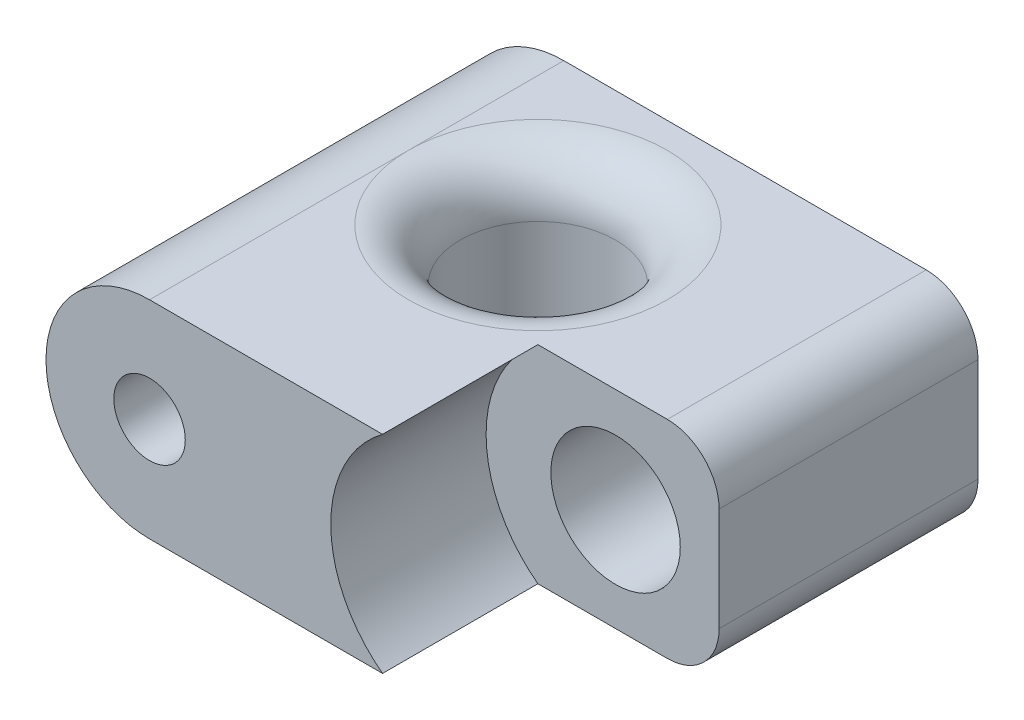
ISO-10303-21;
HEADER;
FILE_DESCRIPTION(('STEP AP214'),'2;1');
FILE_NAME('part.step','',(''),(''),'','','');
FILE_SCHEMA(('AUTOMOTIVE_DESIGN { 1 0 10303 214 1 1 1 1 }'));
ENDSEC;
DATA;
#1=APPLICATION_CONTEXT('core data for automotive mechanical design processes');
#2=APPLICATION_PROTOCOL_DEFINITION('international standard','automotive_design',2000,#1);
#3=PRODUCT_CONTEXT('',#1,'mechanical');
#4=PRODUCT('Part','Part','',(#3));
#5=PRODUCT_RELATED_PRODUCT_CATEGORY('part','',(#4));
#6=PRODUCT_DEFINITION_FORMATION('','',#4);
#7=PRODUCT_DEFINITION_CONTEXT('part definition',#1,'design');
#8=PRODUCT_DEFINITION('design','',#6,#7);
#9=PRODUCT_DEFINITION_SHAPE('','',#8);
#10=(LENGTH_UNIT() NAMED_UNIT(*) SI_UNIT(.MILLI.,.METRE.));
#11=(NAMED_UNIT(*) PLANE_ANGLE_UNIT() SI_UNIT($,.RADIAN.));
#12=(NAMED_UNIT(*) SI_UNIT($,.STERADIAN.) SOLID_ANGLE_UNIT());
#13=UNCERTAINTY_MEASURE_WITH_UNIT(LENGTH_MEASURE(1.E-05),#10,'distance_accuracy_value','');
#14=(GEOMETRIC_REPRESENTATION_CONTEXT(3) GLOBAL_UNCERTAINTY_ASSIGNED_CONTEXT((#13)) GLOBAL_UNIT_ASSIGNED_CONTEXT((#10,
#11,#12)) REPRESENTATION_CONTEXT('',''));
#15=CARTESIAN_POINT('',(0.,0.,0.));
#16=DIRECTION('',(0.,0.,1.));
#17=DIRECTION('',(1.,0.,0.));
#18=AXIS2_PLACEMENT_3D('',#15,#16,#17);
#19=CARTESIAN_POINT('',(0.,0.,20.32));
#20=DIRECTION('',(-1.,0.,0.));
#21=DIRECTION('',(0.,-1.,0.));
#22=AXIS2_PLACEMENT_3D('',#19,#20,#21);
#23=PLANE('',#22);
#24=DIRECTION('',(0.,1.,0.));
#25=VECTOR('',#24,1.);
#26=CARTESIAN_POINT('',(0.,0.,12.7));
#27=LINE('',#26,#25);
#28=CARTESIAN_POINT('',(0.,2.54,12.7));
#29=VERTEX_POINT('',#28);
#30=CARTESIAN_POINT('',(0.,7.62,12.7));
#31=VERTEX_POINT('',#30);
#32=EDGE_CURVE('E46',#29,#31,#27,.T.);
#33=ORIENTED_EDGE('',*,*,#32,.F.);
#34=DIRECTION('',(0.,0.,-1.));
#35=VECTOR('',#34,1.);
#36=CARTESIAN_POINT('',(0.,2.54,20.32));
#37=LINE('',#36,#35);
#38=CARTESIAN_POINT('',(0.,2.54,0.));
#39=VERTEX_POINT('',#38);
#40=EDGE_CURVE('E141',#29,#39,#37,.T.);
#41=ORIENTED_EDGE('',*,*,#40,.T.);
#42=DIRECTION('',(0.,1.,0.));
#43=VECTOR('',#42,1.);
#44=CARTESIAN_POINT('',(0.,0.,0.));
#45=LINE('',#44,#43);
#46=CARTESIAN_POINT('',(0.,7.62,0.));
#47=VERTEX_POINT('',#46);
#48=EDGE_CURVE('E228',#39,#47,#45,.T.);
#49=ORIENTED_EDGE('',*,*,#48,.T.);
#50=DIRECTION('',(0.,0.,-1.));
#51=VECTOR('',#50,1.);
#52=CARTESIAN_POINT('',(0.,7.62,20.32));
#53=LINE('',#52,#51);
#54=EDGE_CURVE('E133',#47,#31,#53,.F.);
#55=ORIENTED_EDGE('',*,*,#54,.T.);
#56=EDGE_LOOP('',(#33,#41,#49,#55));
#57=FACE_BOUND('',#56,.T.);
#58=ADVANCED_FACE('F32',(#57),#23,.F.);
#59=CARTESIAN_POINT('',(-2.54,2.54,20.32));
#60=DIRECTION('',(0.,0.,-1.));
#61=DIRECTION('',(-1.,0.,0.));
#62=AXIS2_PLACEMENT_3D('',#59,#60,#61);
#63=CYLINDRICAL_SURFACE('',#62,2.54);
#64=ORIENTED_EDGE('',*,*,#40,.F.);
#65=CARTESIAN_POINT('',(-2.54,2.54,12.7));
#66=DIRECTION('',(0.,0.,1.));
#67=DIRECTION('',(1.,0.,0.));
#68=AXIS2_PLACEMENT_3D('',#65,#66,#67);
#69=CIRCLE('',#68,2.54);
#70=CARTESIAN_POINT('',(-2.54,0.,12.7));
#71=VERTEX_POINT('',#70);
#72=EDGE_CURVE('E221',#29,#71,#69,.F.);
#73=ORIENTED_EDGE('',*,*,#72,.T.);
#74=DIRECTION('',(0.,0.,-1.));
#75=VECTOR('',#74,1.);
#76=CARTESIAN_POINT('',(-2.54,0.,20.32));
#77=LINE('',#76,#75);
#78=CARTESIAN_POINT('',(-2.54,0.,0.));
#79=VERTEX_POINT('',#78);
#80=EDGE_CURVE('E148',#79,#71,#77,.F.);
#81=ORIENTED_EDGE('',*,*,#80,.F.);
#82=CARTESIAN_POINT('',(-2.54,2.54,0.));
#83=DIRECTION('',(0.,0.,1.));
#84=DIRECTION('',(1.,0.,0.));
#85=AXIS2_PLACEMENT_3D('',#82,#83,#84);
#86=CIRCLE('',#85,2.54);
#87=EDGE_CURVE('E145',#39,#79,#86,.F.);
#88=ORIENTED_EDGE('',*,*,#87,.F.);
#89=EDGE_LOOP('',(#64,#73,#81,#88));
#90=FACE_BOUND('',#89,.T.);
#91=ADVANCED_FACE('F209',(#90),#63,.T.);
#92=CARTESIAN_POINT('',(-2.54,7.62,20.32));
#93=DIRECTION('',(0.,0.,-1.));
#94=DIRECTION('',(-1.,0.,0.));
#95=AXIS2_PLACEMENT_3D('',#92,#93,#94);
#96=CYLINDRICAL_SURFACE('',#95,2.54);
#97=DIRECTION('',(0.,0.,-1.));
#98=VECTOR('',#97,1.);
#99=CARTESIAN_POINT('',(-2.54,10.16,20.32));
#100=LINE('',#99,#98);
#101=CARTESIAN_POINT('',(-2.54,10.16,12.7));
#102=VERTEX_POINT('',#101);
#103=CARTESIAN_POINT('',(-2.54,10.16,0.));
#104=VERTEX_POINT('',#103);
#105=EDGE_CURVE('E151',#102,#104,#100,.T.);
#106=ORIENTED_EDGE('',*,*,#105,.F.);
#107=CARTESIAN_POINT('',(-2.54,7.62,12.7));
#108=DIRECTION('',(0.,0.,1.));
#109=DIRECTION('',(1.,0.,0.));
#110=AXIS2_PLACEMENT_3D('',#107,#108,#109);
#111=CIRCLE('',#110,2.54);
#112=EDGE_CURVE('E11',#102,#31,#111,.F.);
#113=ORIENTED_EDGE('',*,*,#112,.T.);
#114=ORIENTED_EDGE('',*,*,#54,.F.);
#115=CARTESIAN_POINT('',(-2.54,7.62,0.));
#116=DIRECTION('',(0.,0.,1.));
#117=DIRECTION('',(1.,0.,0.));
#118=AXIS2_PLACEMENT_3D('',#115,#116,#117);
#119=CIRCLE('',#118,2.54);
#120=EDGE_CURVE('E143',#104,#47,#119,.F.);
#121=ORIENTED_EDGE('',*,*,#120,.F.);
#122=EDGE_LOOP('',(#106,#113,#114,#121));
#123=FACE_BOUND('',#122,.T.);
#124=ADVANCED_FACE('F214',(#123),#96,.T.);
#125=CARTESIAN_POINT('',(0.,10.16,20.32));
#126=DIRECTION('',(0.,-1.,0.));
#127=DIRECTION('',(1.,0.,0.));
#128=AXIS2_PLACEMENT_3D('',#125,#126,#127);
#129=PLANE('',#128);
#130=DIRECTION('',(-1.,0.,0.));
#131=VECTOR('',#130,1.);
#132=CARTESIAN_POINT('',(0.,10.16,20.32));
#133=LINE('',#132,#131);
#134=CARTESIAN_POINT('',(-8.89,10.16,20.32));
#135=VERTEX_POINT('',#134);
#136=CARTESIAN_POINT('',(-20.32,10.16,20.32));
#137=VERTEX_POINT('',#136);
#138=EDGE_CURVE('E121',#135,#137,#133,.T.);
#139=ORIENTED_EDGE('',*,*,#138,.F.);
#140=DIRECTION('',(0.,0.,1.));
#141=VECTOR('',#140,1.);
#142=CARTESIAN_POINT('',(-8.89,10.16,12.7));
#143=LINE('',#142,#141);
#144=CARTESIAN_POINT('',(-8.89,10.16,12.7));
#145=VERTEX_POINT('',#144);
#146=EDGE_CURVE('E105',#135,#145,#143,.F.);
#147=ORIENTED_EDGE('',*,*,#146,.T.);
#148=DIRECTION('',(-1.,0.,0.));
#149=VECTOR('',#148,1.);
#150=CARTESIAN_POINT('',(0.,10.16,12.7));
#151=LINE('',#150,#149);
#152=EDGE_CURVE('E222',#102,#145,#151,.T.);
#153=ORIENTED_EDGE('',*,*,#152,.F.);
#154=ORIENTED_EDGE('',*,*,#105,.T.);
#155=DIRECTION('',(-1.,0.,0.));
#156=VECTOR('',#155,1.);
#157=CARTESIAN_POINT('',(0.,10.16,0.));
#158=LINE('',#157,#156);
#159=CARTESIAN_POINT('',(-20.32,10.16,0.));
#160=VERTEX_POINT('',#159);
#161=EDGE_CURVE('E135',#104,#160,#158,.T.);
#162=ORIENTED_EDGE('',*,*,#161,.T.);
#163=DIRECTION('',(0.,0.,-1.));
#164=VECTOR('',#163,1.);
#165=CARTESIAN_POINT('',(-20.32,10.16,20.32));
#166=LINE('',#165,#164);
#167=CARTESIAN_POINT('',(-20.32,10.16,7.62));
#168=VERTEX_POINT('',#167);
#169=EDGE_CURVE('E165',#160,#168,#166,.F.);
#170=ORIENTED_EDGE('',*,*,#169,.T.);
#171=CARTESIAN_POINT('',(-13.97,10.16,7.62));
#172=DIRECTION('',(0.,-1.,0.));
#173=DIRECTION('',(1.,0.,0.));
#174=AXIS2_PLACEMENT_3D('',#171,#172,#173);
#175=CIRCLE('',#174,6.35);
#176=EDGE_CURVE('E39',#168,#168,#175,.T.);
#177=ORIENTED_EDGE('',*,*,#176,.T.);
#178=EDGE_CURVE('E129',#168,#137,#166,.F.);
#179=ORIENTED_EDGE('',*,*,#178,.T.);
#180=EDGE_LOOP('',(#139,#147,#153,#154,#162,#170,#177,#179));
#181=FACE_BOUND('',#180,.T.);
#182=ADVANCED_FACE('F127',(#181),#129,.F.);
#183=CARTESIAN_POINT('',(0.,0.,20.32));
#184=DIRECTION('',(0.,1.,0.));
#185=DIRECTION('',(-1.,0.,0.));
#186=AXIS2_PLACEMENT_3D('',#183,#184,#185);
#187=PLANE('',#186);
#188=DIRECTION('',(1.,0.,0.));
#189=VECTOR('',#188,1.);
#190=CARTESIAN_POINT('',(0.,0.,12.7));
#191=LINE('',#190,#189);
#192=CARTESIAN_POINT('',(-8.89,0.,12.7));
#193=VERTEX_POINT('',#192);
#194=EDGE_CURVE('E236',#193,#71,#191,.T.);
#195=ORIENTED_EDGE('',*,*,#194,.F.);
#196=DIRECTION('',(0.,0.,1.));
#197=VECTOR('',#196,1.);
#198=CARTESIAN_POINT('',(-8.89,0.,12.7));
#199=LINE('',#198,#197);
#200=CARTESIAN_POINT('',(-8.89,0.,20.32));
#201=VERTEX_POINT('',#200);
#202=EDGE_CURVE('E116',#193,#201,#199,.T.);
#203=ORIENTED_EDGE('',*,*,#202,.T.);
#204=DIRECTION('',(1.,0.,0.));
#205=VECTOR('',#204,1.);
#206=CARTESIAN_POINT('',(0.,0.,20.32));
#207=LINE('',#206,#205);
#208=CARTESIAN_POINT('',(-20.32,0.,20.32));
#209=VERTEX_POINT('',#208);
#210=EDGE_CURVE('E124',#209,#201,#207,.T.);
#211=ORIENTED_EDGE('',*,*,#210,.F.);
#212=DIRECTION('',(0.,0.,1.));
#213=VECTOR('',#212,1.);
#214=CARTESIAN_POINT('',(-20.32,0.,0.));
#215=LINE('',#214,#213);
#216=CARTESIAN_POINT('',(-20.32,0.,7.62));
#217=VERTEX_POINT('',#216);
#218=EDGE_CURVE('E158',#209,#217,#215,.F.);
#219=ORIENTED_EDGE('',*,*,#218,.T.);
#220=CARTESIAN_POINT('',(-13.97,0.,7.62));
#221=DIRECTION('',(0.,1.,0.));
#222=DIRECTION('',(-1.,0.,0.));
#223=AXIS2_PLACEMENT_3D('',#220,#221,#222);
#224=CIRCLE('',#223,6.35);
#225=EDGE_CURVE('E168',#217,#217,#224,.T.);
#226=ORIENTED_EDGE('',*,*,#225,.T.);
#227=CARTESIAN_POINT('',(-20.32,0.,0.));
#228=VERTEX_POINT('',#227);
#229=EDGE_CURVE('E157',#217,#228,#215,.F.);
#230=ORIENTED_EDGE('',*,*,#229,.T.);
#231=DIRECTION('',(1.,0.,0.));
#232=VECTOR('',#231,1.);
#233=CARTESIAN_POINT('',(0.,0.,0.));
#234=LINE('',#233,#232);
#235=EDGE_CURVE('E131',#228,#79,#234,.T.);
#236=ORIENTED_EDGE('',*,*,#235,.T.);
#237=ORIENTED_EDGE('',*,*,#80,.T.);
#238=EDGE_LOOP('',(#195,#203,#211,#219,#226,#230,#236,#237));
#239=FACE_BOUND('',#238,.T.);
#240=ADVANCED_FACE('F188',(#239),#187,.F.);
#241=CARTESIAN_POINT('',(0.,0.,20.32));
#242=DIRECTION('',(0.,0.,1.));
#243=DIRECTION('',(1.,0.,0.));
#244=AXIS2_PLACEMENT_3D('',#241,#242,#243);
#245=PLANE('',#244);
#246=CARTESIAN_POINT('',(-20.32,5.08,20.32));
#247=DIRECTION('',(0.,0.,1.));
#248=DIRECTION('',(1.,0.,0.));
#249=AXIS2_PLACEMENT_3D('',#246,#247,#248);
#250=CIRCLE('',#249,1.75259999999999);
#251=CARTESIAN_POINT('',(-18.5674,5.08,20.32));
#252=VERTEX_POINT('',#251);
#253=EDGE_CURVE('E246',#252,#252,#250,.T.);
#254=ORIENTED_EDGE('',*,*,#253,.F.);
#255=EDGE_LOOP('',(#254));
#256=FACE_BOUND('',#255,.T.);
#257=CARTESIAN_POINT('',(-5.08,5.08,20.32));
#258=DIRECTION('',(0.,0.,1.));
#259=DIRECTION('',(1.,0.,0.));
#260=AXIS2_PLACEMENT_3D('',#257,#258,#259);
#261=CIRCLE('',#260,6.35);
#262=EDGE_CURVE('E108',#135,#201,#261,.T.);
#263=ORIENTED_EDGE('',*,*,#262,.F.);
#264=ORIENTED_EDGE('',*,*,#138,.T.);
#265=CARTESIAN_POINT('',(-20.32,5.08,20.32));
#266=DIRECTION('',(0.,0.,1.));
#267=DIRECTION('',(1.,0.,0.));
#268=AXIS2_PLACEMENT_3D('',#265,#266,#267);
#269=CIRCLE('',#268,5.08);
#270=CARTESIAN_POINT('',(-25.4,5.08,20.32));
#271=VERTEX_POINT('',#270);
#272=EDGE_CURVE('E153',#137,#271,#269,.T.);
#273=ORIENTED_EDGE('',*,*,#272,.T.);
#274=CARTESIAN_POINT('',(-20.32,5.08,20.32));
#275=DIRECTION('',(0.,0.,1.));
#276=DIRECTION('',(1.,0.,0.));
#277=AXIS2_PLACEMENT_3D('',#274,#275,#276);
#278=CIRCLE('',#277,5.08);
#279=EDGE_CURVE('E155',#271,#209,#278,.T.);
#280=ORIENTED_EDGE('',*,*,#279,.T.);
#281=ORIENTED_EDGE('',*,*,#210,.T.);
#282=EDGE_LOOP('',(#263,#264,#273,#280,#281));
#283=FACE_BOUND('',#282,.T.);
#284=ADVANCED_FACE('F120',(#256,#283),#245,.T.);
#285=CARTESIAN_POINT('',(0.,0.,0.));
#286=DIRECTION('',(0.,0.,1.));
#287=DIRECTION('',(1.,0.,0.));
#288=AXIS2_PLACEMENT_3D('',#285,#286,#287);
#289=PLANE('',#288);
#290=CARTESIAN_POINT('',(-20.32,5.08,0.));
#291=DIRECTION('',(0.,0.,1.));
#292=DIRECTION('',(1.,0.,0.));
#293=AXIS2_PLACEMENT_3D('',#290,#291,#292);
#294=CIRCLE('',#293,1.7526);
#295=CARTESIAN_POINT('',(-18.5674,5.08,0.));
#296=VERTEX_POINT('',#295);
#297=EDGE_CURVE('E249',#296,#296,#294,.T.);
#298=ORIENTED_EDGE('',*,*,#297,.T.);
#299=EDGE_LOOP('',(#298));
#300=FACE_BOUND('',#299,.T.);
#301=CARTESIAN_POINT('',(-5.08,5.04796392922587,0.));
#302=DIRECTION('',(0.,0.,1.));
#303=DIRECTION('',(1.,0.,0.));
#304=AXIS2_PLACEMENT_3D('',#301,#302,#303);
#305=CIRCLE('',#304,3.175);
#306=CARTESIAN_POINT('',(-1.905,5.04796392922587,0.));
#307=VERTEX_POINT('',#306);
#308=EDGE_CURVE('E243',#307,#307,#305,.T.);
#309=ORIENTED_EDGE('',*,*,#308,.T.);
#310=EDGE_LOOP('',(#309));
#311=FACE_BOUND('',#310,.T.);
#312=ORIENTED_EDGE('',*,*,#235,.F.);
#313=CARTESIAN_POINT('',(-20.32,5.08,0.));
#314=DIRECTION('',(0.,0.,1.));
#315=DIRECTION('',(1.,0.,0.));
#316=AXIS2_PLACEMENT_3D('',#313,#314,#315);
#317=CIRCLE('',#316,5.08);
#318=CARTESIAN_POINT('',(-25.4,5.08,0.));
#319=VERTEX_POINT('',#318);
#320=EDGE_CURVE('E163',#228,#319,#317,.F.);
#321=ORIENTED_EDGE('',*,*,#320,.T.);
#322=CARTESIAN_POINT('',(-20.32,5.08,0.));
#323=DIRECTION('',(0.,0.,1.));
#324=DIRECTION('',(1.,0.,0.));
#325=AXIS2_PLACEMENT_3D('',#322,#323,#324);
#326=CIRCLE('',#325,5.08);
#327=EDGE_CURVE('E161',#319,#160,#326,.F.);
#328=ORIENTED_EDGE('',*,*,#327,.T.);
#329=ORIENTED_EDGE('',*,*,#161,.F.);
#330=ORIENTED_EDGE('',*,*,#120,.T.);
#331=ORIENTED_EDGE('',*,*,#48,.F.);
#332=ORIENTED_EDGE('',*,*,#87,.T.);
#333=EDGE_LOOP('',(#312,#321,#328,#329,#330,#331,#332));
#334=FACE_BOUND('',#333,.T.);
#335=ADVANCED_FACE('F229',(#300,#311,#334),#289,.F.);
#336=CARTESIAN_POINT('',(-20.32,5.08,0.));
#337=DIRECTION('',(0.,0.,1.));
#338=DIRECTION('',(1.,0.,0.));
#339=AXIS2_PLACEMENT_3D('',#336,#337,#338);
#340=CYLINDRICAL_SURFACE('',#339,5.08);
#341=ORIENTED_EDGE('',*,*,#169,.F.);
#342=ORIENTED_EDGE('',*,*,#327,.F.);
#343=DIRECTION('',(0.,0.,-1.));
#344=VECTOR('',#343,1.);
#345=CARTESIAN_POINT('',(-25.4,5.08,0.));
#346=LINE('',#345,#344);
#347=EDGE_CURVE('E115',#271,#319,#346,.T.);
#348=ORIENTED_EDGE('',*,*,#347,.F.);
#349=ORIENTED_EDGE('',*,*,#272,.F.);
#350=ORIENTED_EDGE('',*,*,#178,.F.);
#351=EDGE_LOOP('',(#341,#342,#348,#349,#350));
#352=FACE_BOUND('',#351,.T.);
#353=ADVANCED_FACE('F179',(#352),#340,.T.);
#354=CARTESIAN_POINT('',(-20.32,5.08,0.));
#355=DIRECTION('',(0.,0.,-1.));
#356=DIRECTION('',(-1.,0.,0.));
#357=AXIS2_PLACEMENT_3D('',#354,#355,#356);
#358=CYLINDRICAL_SURFACE('',#357,5.08);
#359=ORIENTED_EDGE('',*,*,#320,.F.);
#360=ORIENTED_EDGE('',*,*,#229,.F.);
#361=ORIENTED_EDGE('',*,*,#218,.F.);
#362=ORIENTED_EDGE('',*,*,#279,.F.);
#363=ORIENTED_EDGE('',*,*,#347,.T.);
#364=EDGE_LOOP('',(#359,#360,#361,#362,#363));
#365=FACE_BOUND('',#364,.T.);
#366=ADVANCED_FACE('F191',(#365),#358,.T.);
#367=CARTESIAN_POINT('',(-13.97,0.,7.62));
#368=DIRECTION('',(0.,1.,0.));
#369=DIRECTION('',(-1.,0.,0.));
#370=AXIS2_PLACEMENT_3D('',#367,#368,#369);
#371=CYLINDRICAL_SURFACE('',#370,3.81);
#372=CARTESIAN_POINT('',(-13.97,2.54,7.62));
#373=DIRECTION('',(0.,1.,0.));
#374=DIRECTION('',(-1.,0.,0.));
#375=AXIS2_PLACEMENT_3D('',#372,#373,#374);
#376=CIRCLE('',#375,3.81);
#377=CARTESIAN_POINT('',(-17.78,2.54,7.62));
#378=VERTEX_POINT('',#377);
#379=EDGE_CURVE('E174',#378,#378,#376,.F.);
#380=ORIENTED_EDGE('',*,*,#379,.T.);
#381=EDGE_LOOP('',(#380));
#382=FACE_BOUND('',#381,.T.);
#383=CARTESIAN_POINT('',(-13.97,7.62,7.62));
#384=DIRECTION('',(0.,-1.,0.));
#385=DIRECTION('',(1.,0.,0.));
#386=AXIS2_PLACEMENT_3D('',#383,#384,#385);
#387=CIRCLE('',#386,3.81);
#388=CARTESIAN_POINT('',(-10.16,7.62,7.62));
#389=VERTEX_POINT('',#388);
#390=EDGE_CURVE('E171',#389,#389,#387,.F.);
#391=ORIENTED_EDGE('',*,*,#390,.T.);
#392=EDGE_LOOP('',(#391));
#393=FACE_BOUND('',#392,.T.);
#394=ADVANCED_FACE('F197',(#382,#393),#371,.F.);
#395=CARTESIAN_POINT('',(-13.97,2.54,7.62));
#396=DIRECTION('',(0.,1.,0.));
#397=DIRECTION('',(-1.,0.,0.));
#398=AXIS2_PLACEMENT_3D('',#395,#396,#397);
#399=TOROIDAL_SURFACE('',#398,6.35,2.54);
#400=ORIENTED_EDGE('',*,*,#379,.F.);
#401=EDGE_LOOP('',(#400));
#402=FACE_BOUND('',#401,.T.);
#403=ORIENTED_EDGE('',*,*,#225,.F.);
#404=EDGE_LOOP('',(#403));
#405=FACE_BOUND('',#404,.T.);
#406=ADVANCED_FACE('F194',(#402,#405),#399,.T.);
#407=CARTESIAN_POINT('',(-13.97,7.62,7.62));
#408=DIRECTION('',(0.,-1.,0.));
#409=DIRECTION('',(1.,0.,0.));
#410=AXIS2_PLACEMENT_3D('',#407,#408,#409);
#411=TOROIDAL_SURFACE('',#410,6.35,2.54);
#412=ORIENTED_EDGE('',*,*,#176,.F.);
#413=EDGE_LOOP('',(#412));
#414=FACE_BOUND('',#413,.T.);
#415=ORIENTED_EDGE('',*,*,#390,.F.);
#416=EDGE_LOOP('',(#415));
#417=FACE_BOUND('',#416,.T.);
#418=ADVANCED_FACE('F196',(#414,#417),#411,.T.);
#419=CARTESIAN_POINT('',(-5.08,5.08,12.7));
#420=DIRECTION('',(0.,0.,1.));
#421=DIRECTION('',(1.,0.,0.));
#422=AXIS2_PLACEMENT_3D('',#419,#420,#421);
#423=CYLINDRICAL_SURFACE('',#422,6.35);
#424=ORIENTED_EDGE('',*,*,#262,.T.);
#425=ORIENTED_EDGE('',*,*,#202,.F.);
#426=CARTESIAN_POINT('',(-5.08,5.08,12.7));
#427=DIRECTION('',(0.,0.,1.));
#428=DIRECTION('',(1.,0.,0.));
#429=AXIS2_PLACEMENT_3D('',#426,#427,#428);
#430=CIRCLE('',#429,6.35);
#431=EDGE_CURVE('E111',#145,#193,#430,.T.);
#432=ORIENTED_EDGE('',*,*,#431,.F.);
#433=ORIENTED_EDGE('',*,*,#146,.F.);
#434=EDGE_LOOP('',(#424,#425,#432,#433));
#435=FACE_BOUND('',#434,.T.);
#436=ADVANCED_FACE('F107',(#435),#423,.F.);
#437=CARTESIAN_POINT('',(-5.08,5.08,12.7));
#438=DIRECTION('',(0.,0.,1.));
#439=DIRECTION('',(1.,0.,0.));
#440=AXIS2_PLACEMENT_3D('',#437,#438,#439);
#441=PLANE('',#440);
#442=CARTESIAN_POINT('',(-5.08,5.04796392922587,12.7));
#443=DIRECTION('',(0.,0.,1.));
#444=DIRECTION('',(1.,0.,0.));
#445=AXIS2_PLACEMENT_3D('',#442,#443,#444);
#446=CIRCLE('',#445,3.17499999999999);
#447=CARTESIAN_POINT('',(-1.90500000000001,5.04796392922587,12.7));
#448=VERTEX_POINT('',#447);
#449=EDGE_CURVE('E125',#448,#448,#446,.T.);
#450=ORIENTED_EDGE('',*,*,#449,.F.);
#451=EDGE_LOOP('',(#450));
#452=FACE_BOUND('',#451,.T.);
#453=ORIENTED_EDGE('',*,*,#194,.T.);
#454=ORIENTED_EDGE('',*,*,#72,.F.);
#455=ORIENTED_EDGE('',*,*,#32,.T.);
#456=ORIENTED_EDGE('',*,*,#112,.F.);
#457=ORIENTED_EDGE('',*,*,#152,.T.);
#458=ORIENTED_EDGE('',*,*,#431,.T.);
#459=EDGE_LOOP('',(#453,#454,#455,#456,#457,#458));
#460=FACE_BOUND('',#459,.T.);
#461=ADVANCED_FACE('F338',(#452,#460),#441,.T.);
#462=CARTESIAN_POINT('',(-5.08,5.04796392922587,12.7));
#463=DIRECTION('',(0.,0.,1.));
#464=DIRECTION('',(1.,0.,0.));
#465=AXIS2_PLACEMENT_3D('',#462,#463,#464);
#466=CYLINDRICAL_SURFACE('',#465,3.17499999999999);
#467=ORIENTED_EDGE('',*,*,#308,.F.);
#468=EDGE_LOOP('',(#467));
#469=FACE_BOUND('',#468,.T.);
#470=ORIENTED_EDGE('',*,*,#449,.T.);
#471=EDGE_LOOP('',(#470));
#472=FACE_BOUND('',#471,.T.);
#473=ADVANCED_FACE('F258',(#469,#472),#466,.F.);
#474=CARTESIAN_POINT('',(-20.32,5.08,20.32));
#475=DIRECTION('',(0.,0.,1.));
#476=DIRECTION('',(1.,0.,0.));
#477=AXIS2_PLACEMENT_3D('',#474,#475,#476);
#478=CYLINDRICAL_SURFACE('',#477,1.75259999999999);
#479=ORIENTED_EDGE('',*,*,#297,.F.);
#480=EDGE_LOOP('',(#479));
#481=FACE_BOUND('',#480,.T.);
#482=ORIENTED_EDGE('',*,*,#253,.T.);
#483=EDGE_LOOP('',(#482));
#484=FACE_BOUND('',#483,.T.);
#485=ADVANCED_FACE('F255',(#481,#484),#478,.F.);
#486=CLOSED_SHELL('',(#58,#91,#124,#182,#240,#284,#335,#353,#366,#394,#406,#418,#436,#461,#473,#485));
#487=MANIFOLD_SOLID_BREP('B2',#486);
#488=ADVANCED_BREP_SHAPE_REPRESENTATION('',(#18,#487),#14);
#489=SHAPE_DEFINITION_REPRESENTATION(#9,#488);
ENDSEC;
END-ISO-10303-21;
